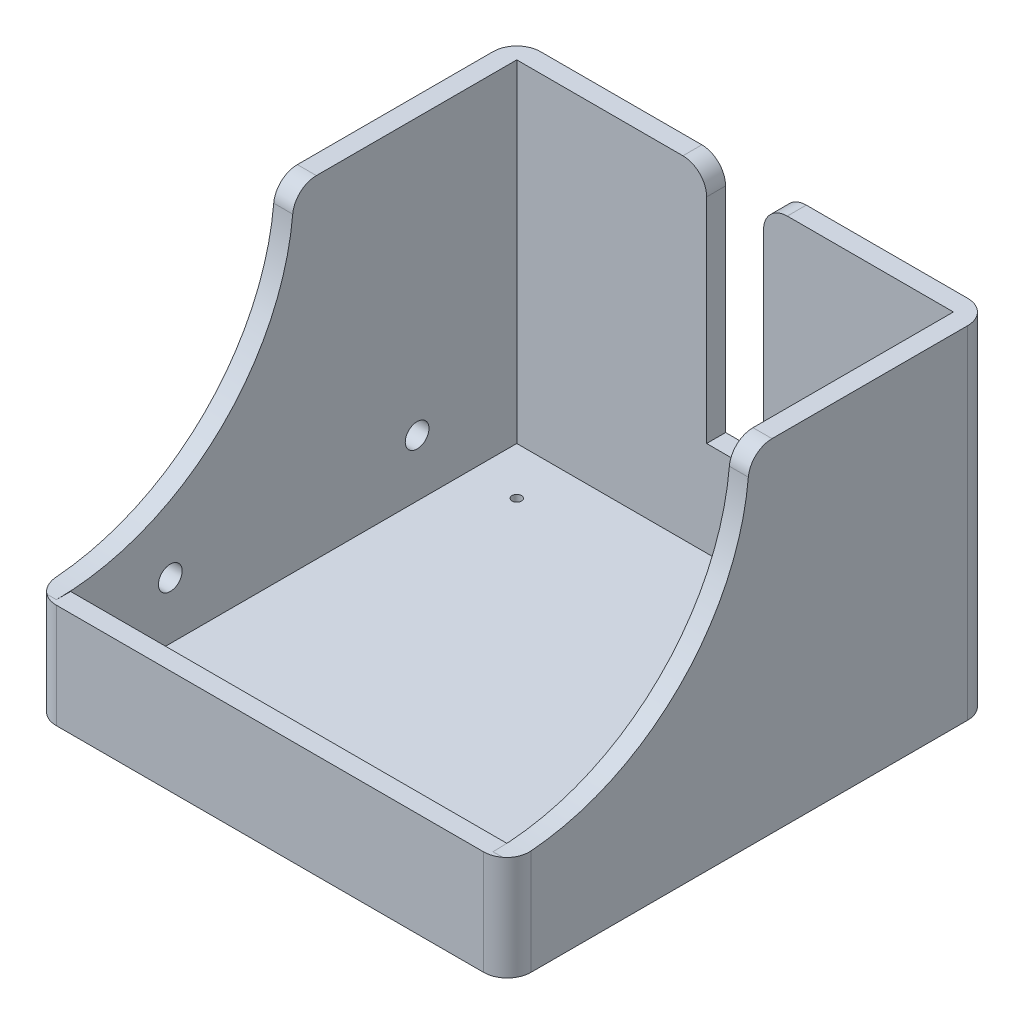
ISO-10303-21;
HEADER;
FILE_DESCRIPTION(('STEP AP214'),'2;1');
FILE_NAME('part.step','',(''),(''),'','','');
FILE_SCHEMA(('AUTOMOTIVE_DESIGN { 1 0 10303 214 1 1 1 1 }'));
ENDSEC;
DATA;
#1=APPLICATION_CONTEXT('core data for automotive mechanical design processes');
#2=APPLICATION_PROTOCOL_DEFINITION('international standard','automotive_design',2000,#1);
#3=PRODUCT_CONTEXT('',#1,'mechanical');
#4=PRODUCT('Part','Part','',(#3));
#5=PRODUCT_RELATED_PRODUCT_CATEGORY('part','',(#4));
#6=PRODUCT_DEFINITION_FORMATION('','',#4);
#7=PRODUCT_DEFINITION_CONTEXT('part definition',#1,'design');
#8=PRODUCT_DEFINITION('design','',#6,#7);
#9=PRODUCT_DEFINITION_SHAPE('','',#8);
#10=(LENGTH_UNIT() NAMED_UNIT(*) SI_UNIT(.MILLI.,.METRE.));
#11=(NAMED_UNIT(*) PLANE_ANGLE_UNIT() SI_UNIT($,.RADIAN.));
#12=(NAMED_UNIT(*) SI_UNIT($,.STERADIAN.) SOLID_ANGLE_UNIT());
#13=UNCERTAINTY_MEASURE_WITH_UNIT(LENGTH_MEASURE(1.E-05),#10,'distance_accuracy_value','');
#14=(GEOMETRIC_REPRESENTATION_CONTEXT(3) GLOBAL_UNCERTAINTY_ASSIGNED_CONTEXT((#13)) GLOBAL_UNIT_ASSIGNED_CONTEXT((#10,
#11,#12)) REPRESENTATION_CONTEXT('',''));
#15=CARTESIAN_POINT('',(0.,0.,0.));
#16=DIRECTION('',(0.,0.,1.));
#17=DIRECTION('',(1.,0.,0.));
#18=AXIS2_PLACEMENT_3D('',#15,#16,#17);
#19=CARTESIAN_POINT('',(-50.,65.,-4.77225575051662));
#20=DIRECTION('',(1.,0.,0.));
#21=DIRECTION('',(0.,0.,-1.));
#22=AXIS2_PLACEMENT_3D('',#19,#20,#21);
#23=CYLINDRICAL_SURFACE('',#22,5.);
#24=DIRECTION('',(1.,0.,0.));
#25=VECTOR('',#24,1.);
#26=CARTESIAN_POINT('',(-50.,65.4545454545455,0.207040226803075));
#27=LINE('',#26,#25);
#28=CARTESIAN_POINT('',(-46.,65.4545454545454,0.207040226803075));
#29=VERTEX_POINT('',#28);
#30=CARTESIAN_POINT('',(-50.,65.4545454545455,0.207040226803075));
#31=VERTEX_POINT('',#30);
#32=EDGE_CURVE('E516',#29,#31,#27,.F.);
#33=ORIENTED_EDGE('',*,*,#32,.F.);
#34=CARTESIAN_POINT('',(-46.,65.,-4.77225575051662));
#35=DIRECTION('',(1.,0.,0.));
#36=DIRECTION('',(0.,0.,-1.));
#37=AXIS2_PLACEMENT_3D('',#34,#35,#36);
#38=CIRCLE('',#37,5.);
#39=CARTESIAN_POINT('',(-46.,70.,-4.77225575051662));
#40=VERTEX_POINT('',#39);
#41=EDGE_CURVE('E46',#40,#29,#38,.T.);
#42=ORIENTED_EDGE('',*,*,#41,.F.);
#43=DIRECTION('',(1.,0.,0.));
#44=VECTOR('',#43,1.);
#45=CARTESIAN_POINT('',(-45.,70.,-4.77225575051662));
#46=LINE('',#45,#44);
#47=CARTESIAN_POINT('',(-50.,70.,-4.77225575051662));
#48=VERTEX_POINT('',#47);
#49=EDGE_CURVE('E518',#48,#40,#46,.T.);
#50=ORIENTED_EDGE('',*,*,#49,.F.);
#51=CARTESIAN_POINT('',(-50.,65.,-4.77225575051662));
#52=DIRECTION('',(1.,0.,0.));
#53=DIRECTION('',(0.,0.,-1.));
#54=AXIS2_PLACEMENT_3D('',#51,#52,#53);
#55=CIRCLE('',#54,5.);
#56=EDGE_CURVE('E11',#31,#48,#55,.F.);
#57=ORIENTED_EDGE('',*,*,#56,.F.);
#58=EDGE_LOOP('',(#33,#42,#50,#57));
#59=FACE_BOUND('',#58,.T.);
#60=ADVANCED_FACE('F39',(#59),#23,.T.);
#61=CARTESIAN_POINT('',(46.,65.,-4.77225575051662));
#62=DIRECTION('',(1.,0.,0.));
#63=DIRECTION('',(0.,0.,-1.));
#64=AXIS2_PLACEMENT_3D('',#61,#62,#63);
#65=CYLINDRICAL_SURFACE('',#64,5.);
#66=DIRECTION('',(1.,0.,0.));
#67=VECTOR('',#66,1.);
#68=CARTESIAN_POINT('',(46.,65.4545454545455,0.207040226803075));
#69=LINE('',#68,#67);
#70=CARTESIAN_POINT('',(50.,65.4545454545454,0.207040226803075));
#71=VERTEX_POINT('',#70);
#72=CARTESIAN_POINT('',(46.,65.4545454545454,0.207040226803075));
#73=VERTEX_POINT('',#72);
#74=EDGE_CURVE('E335',#71,#73,#69,.F.);
#75=ORIENTED_EDGE('',*,*,#74,.F.);
#76=CARTESIAN_POINT('',(50.,65.,-4.77225575051662));
#77=DIRECTION('',(-1.,0.,0.));
#78=DIRECTION('',(0.,0.,1.));
#79=AXIS2_PLACEMENT_3D('',#76,#77,#78);
#80=CIRCLE('',#79,5.);
#81=CARTESIAN_POINT('',(50.,70.,-4.77225575051632));
#82=VERTEX_POINT('',#81);
#83=EDGE_CURVE('E338',#82,#71,#80,.F.);
#84=ORIENTED_EDGE('',*,*,#83,.F.);
#85=DIRECTION('',(1.,0.,0.));
#86=VECTOR('',#85,1.);
#87=CARTESIAN_POINT('',(45.,70.,-4.77225575051662));
#88=LINE('',#87,#86);
#89=CARTESIAN_POINT('',(46.,70.,-4.77225575051662));
#90=VERTEX_POINT('',#89);
#91=EDGE_CURVE('E343',#90,#82,#88,.T.);
#92=ORIENTED_EDGE('',*,*,#91,.F.);
#93=CARTESIAN_POINT('',(46.,65.,-4.77225575051662));
#94=DIRECTION('',(-1.,0.,0.));
#95=DIRECTION('',(0.,0.,1.));
#96=AXIS2_PLACEMENT_3D('',#93,#94,#95);
#97=CIRCLE('',#96,5.);
#98=EDGE_CURVE('E340',#73,#90,#97,.T.);
#99=ORIENTED_EDGE('',*,*,#98,.F.);
#100=EDGE_LOOP('',(#75,#84,#92,#99));
#101=FACE_BOUND('',#100,.T.);
#102=ADVANCED_FACE('F324',(#101),#65,.T.);
#103=CARTESIAN_POINT('',(11.,65.,-51.));
#104=DIRECTION('',(0.,0.,-1.));
#105=DIRECTION('',(-1.,0.,0.));
#106=AXIS2_PLACEMENT_3D('',#103,#104,#105);
#107=CYLINDRICAL_SURFACE('',#106,5.);
#108=DIRECTION('',(0.,0.,-1.));
#109=VECTOR('',#108,1.);
#110=CARTESIAN_POINT('',(5.99999999999999,65.,-51.));
#111=LINE('',#110,#109);
#112=CARTESIAN_POINT('',(5.99999999999999,65.,-47.));
#113=VERTEX_POINT('',#112);
#114=CARTESIAN_POINT('',(5.99999999999999,65.,-51.));
#115=VERTEX_POINT('',#114);
#116=EDGE_CURVE('E205',#113,#115,#111,.T.);
#117=ORIENTED_EDGE('',*,*,#116,.F.);
#118=CARTESIAN_POINT('',(11.,65.,-47.));
#119=DIRECTION('',(0.,0.,1.));
#120=DIRECTION('',(1.,0.,0.));
#121=AXIS2_PLACEMENT_3D('',#118,#119,#120);
#122=CIRCLE('',#121,5.);
#123=CARTESIAN_POINT('',(11.,70.,-47.));
#124=VERTEX_POINT('',#123);
#125=EDGE_CURVE('E510',#124,#113,#122,.T.);
#126=ORIENTED_EDGE('',*,*,#125,.F.);
#127=DIRECTION('',(0.,0.,-1.));
#128=VECTOR('',#127,1.);
#129=CARTESIAN_POINT('',(11.,70.,-46.));
#130=LINE('',#129,#128);
#131=CARTESIAN_POINT('',(11.,70.,-51.));
#132=VERTEX_POINT('',#131);
#133=EDGE_CURVE('E507',#132,#124,#130,.F.);
#134=ORIENTED_EDGE('',*,*,#133,.F.);
#135=CARTESIAN_POINT('',(11.,65.,-51.));
#136=DIRECTION('',(0.,0.,1.));
#137=DIRECTION('',(1.,0.,0.));
#138=AXIS2_PLACEMENT_3D('',#135,#136,#137);
#139=CIRCLE('',#138,5.);
#140=EDGE_CURVE('E344',#115,#132,#139,.F.);
#141=ORIENTED_EDGE('',*,*,#140,.F.);
#142=EDGE_LOOP('',(#117,#126,#134,#141));
#143=FACE_BOUND('',#142,.T.);
#144=ADVANCED_FACE('F321',(#143),#107,.T.);
#145=CARTESIAN_POINT('',(-11.,65.,-51.));
#146=DIRECTION('',(0.,0.,1.));
#147=DIRECTION('',(1.,0.,0.));
#148=AXIS2_PLACEMENT_3D('',#145,#146,#147);
#149=CYLINDRICAL_SURFACE('',#148,5.);
#150=DIRECTION('',(0.,0.,1.));
#151=VECTOR('',#150,1.);
#152=CARTESIAN_POINT('',(-6.00000000000001,65.,-51.));
#153=LINE('',#152,#151);
#154=CARTESIAN_POINT('',(-6.00000000000001,65.,-51.));
#155=VERTEX_POINT('',#154);
#156=CARTESIAN_POINT('',(-6.00000000000001,65.,-47.));
#157=VERTEX_POINT('',#156);
#158=EDGE_CURVE('E494',#155,#157,#153,.T.);
#159=ORIENTED_EDGE('',*,*,#158,.F.);
#160=CARTESIAN_POINT('',(-11.,65.,-51.));
#161=DIRECTION('',(0.,0.,1.));
#162=DIRECTION('',(1.,0.,0.));
#163=AXIS2_PLACEMENT_3D('',#160,#161,#162);
#164=CIRCLE('',#163,5.);
#165=CARTESIAN_POINT('',(-11.,70.,-51.));
#166=VERTEX_POINT('',#165);
#167=EDGE_CURVE('E502',#166,#155,#164,.F.);
#168=ORIENTED_EDGE('',*,*,#167,.F.);
#169=DIRECTION('',(0.,0.,1.));
#170=VECTOR('',#169,1.);
#171=CARTESIAN_POINT('',(-11.,70.,-46.));
#172=LINE('',#171,#170);
#173=CARTESIAN_POINT('',(-11.,70.,-47.));
#174=VERTEX_POINT('',#173);
#175=EDGE_CURVE('E497',#174,#166,#172,.F.);
#176=ORIENTED_EDGE('',*,*,#175,.F.);
#177=CARTESIAN_POINT('',(-11.,65.,-47.));
#178=DIRECTION('',(0.,0.,1.));
#179=DIRECTION('',(1.,0.,0.));
#180=AXIS2_PLACEMENT_3D('',#177,#178,#179);
#181=CIRCLE('',#180,5.);
#182=EDGE_CURVE('E504',#157,#174,#181,.T.);
#183=ORIENTED_EDGE('',*,*,#182,.F.);
#184=EDGE_LOOP('',(#159,#168,#176,#183));
#185=FACE_BOUND('',#184,.T.);
#186=ADVANCED_FACE('F317',(#185),#149,.T.);
#187=CARTESIAN_POINT('',(-50.,70.,50.));
#188=DIRECTION('',(1.,0.,0.));
#189=DIRECTION('',(0.,0.,-1.));
#190=AXIS2_PLACEMENT_3D('',#187,#188,#189);
#191=CYLINDRICAL_SURFACE('',#190,50.);
#192=CARTESIAN_POINT('',(-46.,70.,50.));
#193=DIRECTION('',(1.,0.,0.));
#194=DIRECTION('',(0.,0.,-1.));
#195=AXIS2_PLACEMENT_3D('',#192,#193,#194);
#196=CIRCLE('',#195,50.);
#197=CARTESIAN_POINT('',(-46.,20.,50.));
#198=VERTEX_POINT('',#197);
#199=EDGE_CURVE('E492',#198,#29,#196,.T.);
#200=ORIENTED_EDGE('',*,*,#199,.T.);
#201=ORIENTED_EDGE('',*,*,#32,.T.);
#202=CARTESIAN_POINT('',(-50.,70.,50.));
#203=DIRECTION('',(1.,0.,0.));
#204=DIRECTION('',(0.,0.,-1.));
#205=AXIS2_PLACEMENT_3D('',#202,#203,#204);
#206=CIRCLE('',#205,50.);
#207=CARTESIAN_POINT('',(-50.0000000000023,20.1602568224914,45.9999999999997));
#208=VERTEX_POINT('',#207);
#209=EDGE_CURVE('E309',#31,#208,#206,.F.);
#210=ORIENTED_EDGE('',*,*,#209,.T.);
#211=CARTESIAN_POINT('',(-48.,20.,50.));
#212=CARTESIAN_POINT('',(-48.1123123251652,19.9999999621787,49.9157829697156));
#213=CARTESIAN_POINT('',(-48.2210566808221,20.0002127225069,49.8268176929407));
#214=CARTESIAN_POINT('',(-48.4306803005446,20.001208337083,49.6400688826818));
#215=CARTESIAN_POINT('',(-48.5315598434387,20.0019911711101,49.5422856620826));
#216=CARTESIAN_POINT('',(-48.7245798726093,20.004269605554,49.3387343544107));
#217=CARTESIAN_POINT('',(-48.8167339388138,20.0057640758023,49.2329791512277));
#218=CARTESIAN_POINT('',(-48.9918131893981,20.0095999288473,49.0141475279462));
#219=CARTESIAN_POINT('',(-49.0747385435184,20.0119412960639,48.9010712425622));
#220=CARTESIAN_POINT('',(-49.3088947249991,20.0204355089331,48.5518369135647));
#221=CARTESIAN_POINT('',(-49.4455059994393,20.0280584687343,48.3056730505683));
#222=CARTESIAN_POINT('',(-49.6754605481454,20.0480301377561,47.7940792880293));
#223=CARTESIAN_POINT('',(-49.7688035733922,20.0603788741739,47.5286492776157));
#224=CARTESIAN_POINT('',(-49.8744143952217,20.0826911412991,47.1223622843285));
#225=CARTESIAN_POINT('',(-49.9038763737808,20.0907538811201,46.9856641127528));
#226=CARTESIAN_POINT('',(-49.9512556598506,20.1081468129322,46.7103230919928));
#227=CARTESIAN_POINT('',(-49.96917270827,20.1174770333624,46.5716801992363));
#228=CARTESIAN_POINT('',(-49.9933506695898,20.1373928848912,46.2932637303609));
#229=CARTESIAN_POINT('',(-49.9995935320742,20.1479804332144,46.1534887383452));
#230=CARTESIAN_POINT('',(-50.0003686929585,20.1703310475078,45.8739976084017));
#231=CARTESIAN_POINT('',(-49.9949007713998,20.1820941355537,45.7342814716287));
#232=CARTESIAN_POINT('',(-49.9835775076746,20.1944106150313,45.5950861511387));
#233=B_SPLINE_CURVE_WITH_KNOTS('',3,(#211,#212,#213,#214,#215,#216,#217,#218,#219,#220,#221,
#222,#223,#224,#225,#226,#227,#228,#229,#230,#231,#232),.UNSPECIFIED.,.F.,.F.,(4,2,2,2,2,2,2,2,
2,2,4),(0.,0.421005170012259,0.841995407476477,1.26231927768689,1.68263541575301,
2.52326627872219,3.36390197966348,3.78369631925029,4.20350007953188,4.62395239784628,
5.04441261340953),.UNSPECIFIED.);
#234=CARTESIAN_POINT('',(-48.,20.,50.));
#235=VERTEX_POINT('',#234);
#236=EDGE_CURVE('E301',#235,#208,#233,.T.);
#237=ORIENTED_EDGE('',*,*,#236,.F.);
#238=DIRECTION('',(1.,0.,0.));
#239=VECTOR('',#238,1.);
#240=CARTESIAN_POINT('',(45.,20.,50.));
#241=LINE('',#240,#239);
#242=EDGE_CURVE('E310',#198,#235,#241,.F.);
#243=ORIENTED_EDGE('',*,*,#242,.F.);
#244=EDGE_LOOP('',(#200,#201,#210,#237,#243));
#245=FACE_BOUND('',#244,.T.);
#246=ADVANCED_FACE('F313',(#245),#191,.F.);
#247=CARTESIAN_POINT('',(46.,70.,50.));
#248=DIRECTION('',(1.,0.,0.));
#249=DIRECTION('',(0.,0.,-1.));
#250=AXIS2_PLACEMENT_3D('',#247,#248,#249);
#251=CYLINDRICAL_SURFACE('',#250,50.);
#252=CARTESIAN_POINT('',(50.,70.,50.));
#253=DIRECTION('',(-1.,0.,0.));
#254=DIRECTION('',(0.,0.,1.));
#255=AXIS2_PLACEMENT_3D('',#252,#253,#254);
#256=CIRCLE('',#255,50.);
#257=CARTESIAN_POINT('',(50.0000000000023,20.1602568224914,45.9999999999997));
#258=VERTEX_POINT('',#257);
#259=EDGE_CURVE('E348',#258,#71,#256,.F.);
#260=ORIENTED_EDGE('',*,*,#259,.T.);
#261=ORIENTED_EDGE('',*,*,#74,.T.);
#262=CARTESIAN_POINT('',(46.,70.,50.));
#263=DIRECTION('',(-1.,0.,0.));
#264=DIRECTION('',(0.,0.,1.));
#265=AXIS2_PLACEMENT_3D('',#262,#263,#264);
#266=CIRCLE('',#265,50.);
#267=CARTESIAN_POINT('',(46.,20.,50.));
#268=VERTEX_POINT('',#267);
#269=EDGE_CURVE('E265',#73,#268,#266,.T.);
#270=ORIENTED_EDGE('',*,*,#269,.T.);
#271=DIRECTION('',(1.,0.,0.));
#272=VECTOR('',#271,1.);
#273=CARTESIAN_POINT('',(45.,20.,50.));
#274=LINE('',#273,#272);
#275=CARTESIAN_POINT('',(48.,20.,50.));
#276=VERTEX_POINT('',#275);
#277=EDGE_CURVE('E254',#276,#268,#274,.F.);
#278=ORIENTED_EDGE('',*,*,#277,.F.);
#279=CARTESIAN_POINT('',(47.9999999999994,20.,50.0000000000004));
#280=CARTESIAN_POINT('',(48.1123123251647,19.9999999621787,49.9157829697161));
#281=CARTESIAN_POINT('',(48.2210566808216,20.0002127225069,49.8268176929412));
#282=CARTESIAN_POINT('',(48.4306803005441,20.001208337083,49.6400688826822));
#283=CARTESIAN_POINT('',(48.5315598434382,20.0019911711101,49.5422856620831));
#284=CARTESIAN_POINT('',(48.7245798726089,20.0042696055539,49.3387343544113));
#285=CARTESIAN_POINT('',(48.8167339388133,20.0057640758023,49.2329791512283));
#286=CARTESIAN_POINT('',(48.9918131893977,20.0095999288473,49.0141475279467));
#287=CARTESIAN_POINT('',(49.074738543518,20.0119412960639,48.9010712425627));
#288=CARTESIAN_POINT('',(49.3088947249988,20.0204355089331,48.5518369135653));
#289=CARTESIAN_POINT('',(49.445505999439,20.0280584687343,48.3056730505689));
#290=CARTESIAN_POINT('',(49.6754605481452,20.048030137756,47.79407928803));
#291=CARTESIAN_POINT('',(49.7688035733919,20.0603788741739,47.5286492776163));
#292=CARTESIAN_POINT('',(49.8744143952216,20.0826911412991,47.1223622843292));
#293=CARTESIAN_POINT('',(49.9038763737807,20.09075388112,46.9856641127535));
#294=CARTESIAN_POINT('',(49.9512556598505,20.1081468129321,46.7103230919935));
#295=CARTESIAN_POINT('',(49.96917270827,20.1174770333624,46.571680199237));
#296=CARTESIAN_POINT('',(49.9933506695898,20.1373928848911,46.2932637303616));
#297=CARTESIAN_POINT('',(49.9995935320742,20.1479804332144,46.1534887383458));
#298=CARTESIAN_POINT('',(50.0003686929585,20.1703310475078,45.8739976084024));
#299=CARTESIAN_POINT('',(49.9949007713998,20.1820941355537,45.7342814716294));
#300=CARTESIAN_POINT('',(49.9835775076747,20.1944106150312,45.5950861511394));
#301=B_SPLINE_CURVE_WITH_KNOTS('',3,(#279,#280,#281,#282,#283,#284,#285,#286,#287,#288,#289,
#290,#291,#292,#293,#294,#295,#296,#297,#298,#299,#300),.UNSPECIFIED.,.F.,.F.,(4,2,2,2,2,2,2,2,
2,2,4),(0.,0.421005170012259,0.841995407476478,1.26231927768689,1.68263541575301,
2.5232662787222,3.36390197966349,3.7836963192503,4.20350007953189,4.6239523978463,
5.04441261340955),.UNSPECIFIED.);
#302=EDGE_CURVE('E257',#258,#276,#301,.F.);
#303=ORIENTED_EDGE('',*,*,#302,.F.);
#304=EDGE_LOOP('',(#260,#261,#270,#278,#303));
#305=FACE_BOUND('',#304,.T.);
#306=ADVANCED_FACE('F267',(#305),#251,.F.);
#307=CARTESIAN_POINT('',(45.,20.,46.));
#308=DIRECTION('',(0.,1.,0.));
#309=DIRECTION('',(0.,0.,1.));
#310=AXIS2_PLACEMENT_3D('',#307,#308,#309);
#311=PLANE('',#310);
#312=DIRECTION('',(0.,0.,1.));
#313=VECTOR('',#312,1.);
#314=CARTESIAN_POINT('',(-46.,20.,-47.));
#315=LINE('',#314,#313);
#316=CARTESIAN_POINT('',(-46.,20.,47.));
#317=VERTEX_POINT('',#316);
#318=EDGE_CURVE('E350',#317,#198,#315,.T.);
#319=ORIENTED_EDGE('',*,*,#318,.T.);
#320=ORIENTED_EDGE('',*,*,#242,.T.);
#321=CARTESIAN_POINT('',(-45.,20.,46.));
#322=DIRECTION('',(0.,1.,0.));
#323=DIRECTION('',(0.,0.,-1.));
#324=AXIS2_PLACEMENT_3D('',#321,#322,#323);
#325=CIRCLE('',#324,5.);
#326=CARTESIAN_POINT('',(-45.,20.,51.));
#327=VERTEX_POINT('',#326);
#328=EDGE_CURVE('E225',#235,#327,#325,.T.);
#329=ORIENTED_EDGE('',*,*,#328,.T.);
#330=DIRECTION('',(1.,0.,0.));
#331=VECTOR('',#330,1.);
#332=CARTESIAN_POINT('',(-45.,20.,51.));
#333=LINE('',#332,#331);
#334=CARTESIAN_POINT('',(45.,20.,51.));
#335=VERTEX_POINT('',#334);
#336=EDGE_CURVE('E228',#327,#335,#333,.T.);
#337=ORIENTED_EDGE('',*,*,#336,.T.);
#338=CARTESIAN_POINT('',(45.,20.,46.));
#339=DIRECTION('',(0.,1.,0.));
#340=DIRECTION('',(0.,0.,1.));
#341=AXIS2_PLACEMENT_3D('',#338,#339,#340);
#342=CIRCLE('',#341,5.);
#343=EDGE_CURVE('E226',#335,#276,#342,.T.);
#344=ORIENTED_EDGE('',*,*,#343,.T.);
#345=ORIENTED_EDGE('',*,*,#277,.T.);
#346=DIRECTION('',(0.,0.,-1.));
#347=VECTOR('',#346,1.);
#348=CARTESIAN_POINT('',(46.,20.,-47.));
#349=LINE('',#348,#347);
#350=CARTESIAN_POINT('',(46.,20.,47.));
#351=VERTEX_POINT('',#350);
#352=EDGE_CURVE('E252',#268,#351,#349,.T.);
#353=ORIENTED_EDGE('',*,*,#352,.T.);
#354=DIRECTION('',(1.,0.,0.));
#355=VECTOR('',#354,1.);
#356=CARTESIAN_POINT('',(-46.,20.,47.));
#357=LINE('',#356,#355);
#358=EDGE_CURVE('E370',#317,#351,#357,.T.);
#359=ORIENTED_EDGE('',*,*,#358,.F.);
#360=EDGE_LOOP('',(#319,#320,#329,#337,#344,#345,#353,#359));
#361=FACE_BOUND('',#360,.T.);
#362=ADVANCED_FACE('F355',(#361),#311,.T.);
#363=DIRECTION('',(-1.,0.,0.));
#364=VECTOR('',#363,1.);
#365=CARTESIAN_POINT('',(-46.,20.,-47.));
#366=LINE('',#365,#364);
#367=CARTESIAN_POINT('',(5.99999999999999,20.,-47.));
#368=VERTEX_POINT('',#367);
#369=CARTESIAN_POINT('',(-6.00000000000001,20.,-47.));
#370=VERTEX_POINT('',#369);
#371=EDGE_CURVE('E218',#368,#370,#366,.T.);
#372=ORIENTED_EDGE('',*,*,#371,.F.);
#373=DIRECTION('',(0.,0.,1.));
#374=VECTOR('',#373,1.);
#375=CARTESIAN_POINT('',(5.99999999999999,20.,-51.));
#376=LINE('',#375,#374);
#377=CARTESIAN_POINT('',(5.99999999999999,20.,-51.));
#378=VERTEX_POINT('',#377);
#379=EDGE_CURVE('E202',#378,#368,#376,.T.);
#380=ORIENTED_EDGE('',*,*,#379,.F.);
#381=DIRECTION('',(-1.,0.,0.));
#382=VECTOR('',#381,1.);
#383=CARTESIAN_POINT('',(-45.,20.,-51.));
#384=LINE('',#383,#382);
#385=CARTESIAN_POINT('',(-6.00000000000001,20.,-51.));
#386=VERTEX_POINT('',#385);
#387=EDGE_CURVE('E215',#378,#386,#384,.T.);
#388=ORIENTED_EDGE('',*,*,#387,.T.);
#389=DIRECTION('',(0.,0.,-1.));
#390=VECTOR('',#389,1.);
#391=CARTESIAN_POINT('',(-6.00000000000001,20.,-51.));
#392=LINE('',#391,#390);
#393=EDGE_CURVE('E219',#370,#386,#392,.T.);
#394=ORIENTED_EDGE('',*,*,#393,.F.);
#395=EDGE_LOOP('',(#372,#380,#388,#394));
#396=FACE_BOUND('',#395,.T.);
#397=ADVANCED_FACE('F213',(#396),#311,.T.);
#398=CARTESIAN_POINT('',(45.,20.,46.));
#399=DIRECTION('',(0.,-1.,0.));
#400=DIRECTION('',(0.,0.,-1.));
#401=AXIS2_PLACEMENT_3D('',#398,#399,#400);
#402=CYLINDRICAL_SURFACE('',#401,5.);
#403=DIRECTION('',(0.,-1.,0.));
#404=VECTOR('',#403,1.);
#405=CARTESIAN_POINT('',(45.,20.,51.));
#406=LINE('',#405,#404);
#407=CARTESIAN_POINT('',(45.,-2.,51.));
#408=VERTEX_POINT('',#407);
#409=EDGE_CURVE('E236',#335,#408,#406,.T.);
#410=ORIENTED_EDGE('',*,*,#409,.T.);
#411=CARTESIAN_POINT('',(45.,-2.,46.));
#412=DIRECTION('',(0.,-1.,0.));
#413=DIRECTION('',(0.,0.,-1.));
#414=AXIS2_PLACEMENT_3D('',#411,#412,#413);
#415=CIRCLE('',#414,5.);
#416=CARTESIAN_POINT('',(50.,-2.,46.));
#417=VERTEX_POINT('',#416);
#418=EDGE_CURVE('E406',#417,#408,#415,.T.);
#419=ORIENTED_EDGE('',*,*,#418,.F.);
#420=DIRECTION('',(0.,-1.,0.));
#421=VECTOR('',#420,1.);
#422=CARTESIAN_POINT('',(50.,20.,46.));
#423=LINE('',#422,#421);
#424=EDGE_CURVE('E250',#258,#417,#423,.T.);
#425=ORIENTED_EDGE('',*,*,#424,.F.);
#426=ORIENTED_EDGE('',*,*,#302,.T.);
#427=ORIENTED_EDGE('',*,*,#343,.F.);
#428=EDGE_LOOP('',(#410,#419,#425,#426,#427));
#429=FACE_BOUND('',#428,.T.);
#430=ADVANCED_FACE('F270',(#429),#402,.T.);
#431=CARTESIAN_POINT('',(50.,20.,-46.));
#432=DIRECTION('',(-1.,0.,0.));
#433=DIRECTION('',(0.,0.,1.));
#434=AXIS2_PLACEMENT_3D('',#431,#432,#433);
#435=PLANE('',#434);
#436=DIRECTION('',(0.,0.,-1.));
#437=VECTOR('',#436,1.);
#438=CARTESIAN_POINT('',(50.,70.,0.));
#439=LINE('',#438,#437);
#440=CARTESIAN_POINT('',(50.,70.,-46.));
#441=VERTEX_POINT('',#440);
#442=EDGE_CURVE('E464',#82,#441,#439,.T.);
#443=ORIENTED_EDGE('',*,*,#442,.F.);
#444=ORIENTED_EDGE('',*,*,#83,.T.);
#445=ORIENTED_EDGE('',*,*,#259,.F.);
#446=ORIENTED_EDGE('',*,*,#424,.T.);
#447=DIRECTION('',(0.,0.,1.));
#448=VECTOR('',#447,1.);
#449=CARTESIAN_POINT('',(50.,-2.,-46.));
#450=LINE('',#449,#448);
#451=CARTESIAN_POINT('',(50.,-2.,-46.));
#452=VERTEX_POINT('',#451);
#453=EDGE_CURVE('E409',#452,#417,#450,.T.);
#454=ORIENTED_EDGE('',*,*,#453,.F.);
#455=DIRECTION('',(0.,-1.,0.));
#456=VECTOR('',#455,1.);
#457=CARTESIAN_POINT('',(50.,20.,-46.));
#458=LINE('',#457,#456);
#459=EDGE_CURVE('E248',#441,#452,#458,.T.);
#460=ORIENTED_EDGE('',*,*,#459,.F.);
#461=EDGE_LOOP('',(#443,#444,#445,#446,#454,#460));
#462=FACE_BOUND('',#461,.T.);
#463=ADVANCED_FACE('F274',(#462),#435,.F.);
#464=CARTESIAN_POINT('',(45.,20.,-46.));
#465=DIRECTION('',(0.,-1.,0.));
#466=DIRECTION('',(0.,0.,-1.));
#467=AXIS2_PLACEMENT_3D('',#464,#465,#466);
#468=CYLINDRICAL_SURFACE('',#467,5.);
#469=ORIENTED_EDGE('',*,*,#459,.T.);
#470=CARTESIAN_POINT('',(45.,-2.,-46.));
#471=DIRECTION('',(0.,-1.,0.));
#472=DIRECTION('',(0.,0.,-1.));
#473=AXIS2_PLACEMENT_3D('',#470,#471,#472);
#474=CIRCLE('',#473,5.);
#475=CARTESIAN_POINT('',(45.,-2.,-51.));
#476=VERTEX_POINT('',#475);
#477=EDGE_CURVE('E412',#476,#452,#474,.T.);
#478=ORIENTED_EDGE('',*,*,#477,.F.);
#479=DIRECTION('',(0.,-1.,0.));
#480=VECTOR('',#479,1.);
#481=CARTESIAN_POINT('',(45.,20.,-51.));
#482=LINE('',#481,#480);
#483=CARTESIAN_POINT('',(45.,70.,-51.));
#484=VERTEX_POINT('',#483);
#485=EDGE_CURVE('E246',#484,#476,#482,.T.);
#486=ORIENTED_EDGE('',*,*,#485,.F.);
#487=CARTESIAN_POINT('',(45.,70.,-46.));
#488=DIRECTION('',(0.,1.,0.));
#489=DIRECTION('',(0.,0.,-1.));
#490=AXIS2_PLACEMENT_3D('',#487,#488,#489);
#491=CIRCLE('',#490,5.);
#492=EDGE_CURVE('E466',#441,#484,#491,.T.);
#493=ORIENTED_EDGE('',*,*,#492,.F.);
#494=EDGE_LOOP('',(#469,#478,#486,#493));
#495=FACE_BOUND('',#494,.T.);
#496=ADVANCED_FACE('F278',(#495),#468,.T.);
#497=CARTESIAN_POINT('',(-45.,20.,-51.));
#498=DIRECTION('',(0.,0.,1.));
#499=DIRECTION('',(1.,0.,0.));
#500=AXIS2_PLACEMENT_3D('',#497,#498,#499);
#501=PLANE('',#500);
#502=DIRECTION('',(0.,-1.,0.));
#503=VECTOR('',#502,1.);
#504=CARTESIAN_POINT('',(5.99999999999999,70.,-51.));
#505=LINE('',#504,#503);
#506=EDGE_CURVE('E198',#115,#378,#505,.T.);
#507=ORIENTED_EDGE('',*,*,#506,.F.);
#508=ORIENTED_EDGE('',*,*,#140,.T.);
#509=DIRECTION('',(-1.,0.,0.));
#510=VECTOR('',#509,1.);
#511=CARTESIAN_POINT('',(45.,70.,-51.));
#512=LINE('',#511,#510);
#513=EDGE_CURVE('E469',#484,#132,#512,.T.);
#514=ORIENTED_EDGE('',*,*,#513,.F.);
#515=ORIENTED_EDGE('',*,*,#485,.T.);
#516=DIRECTION('',(1.,0.,0.));
#517=VECTOR('',#516,1.);
#518=CARTESIAN_POINT('',(-45.,-2.,-51.));
#519=LINE('',#518,#517);
#520=CARTESIAN_POINT('',(-45.,-2.,-51.));
#521=VERTEX_POINT('',#520);
#522=EDGE_CURVE('E415',#521,#476,#519,.T.);
#523=ORIENTED_EDGE('',*,*,#522,.F.);
#524=DIRECTION('',(0.,-1.,0.));
#525=VECTOR('',#524,1.);
#526=CARTESIAN_POINT('',(-45.,20.,-51.));
#527=LINE('',#526,#525);
#528=CARTESIAN_POINT('',(-45.,70.,-51.));
#529=VERTEX_POINT('',#528);
#530=EDGE_CURVE('E244',#529,#521,#527,.T.);
#531=ORIENTED_EDGE('',*,*,#530,.F.);
#532=DIRECTION('',(-1.,0.,0.));
#533=VECTOR('',#532,1.);
#534=CARTESIAN_POINT('',(-6.00000000000001,70.,-51.));
#535=LINE('',#534,#533);
#536=EDGE_CURVE('E453',#166,#529,#535,.T.);
#537=ORIENTED_EDGE('',*,*,#536,.F.);
#538=ORIENTED_EDGE('',*,*,#167,.T.);
#539=DIRECTION('',(0.,-1.,0.));
#540=VECTOR('',#539,1.);
#541=CARTESIAN_POINT('',(-6.00000000000001,70.,-51.));
#542=LINE('',#541,#540);
#543=EDGE_CURVE('E224',#155,#386,#542,.T.);
#544=ORIENTED_EDGE('',*,*,#543,.T.);
#545=ORIENTED_EDGE('',*,*,#387,.F.);
#546=EDGE_LOOP('',(#507,#508,#514,#515,#523,#531,#537,#538,#544,#545));
#547=FACE_BOUND('',#546,.T.);
#548=ADVANCED_FACE('F222',(#547),#501,.F.);
#549=CARTESIAN_POINT('',(-45.,20.,-46.));
#550=DIRECTION('',(0.,-1.,0.));
#551=DIRECTION('',(0.,0.,-1.));
#552=AXIS2_PLACEMENT_3D('',#549,#550,#551);
#553=CYLINDRICAL_SURFACE('',#552,5.);
#554=ORIENTED_EDGE('',*,*,#530,.T.);
#555=CARTESIAN_POINT('',(-45.,-2.,-46.));
#556=DIRECTION('',(0.,-1.,0.));
#557=DIRECTION('',(0.,0.,-1.));
#558=AXIS2_PLACEMENT_3D('',#555,#556,#557);
#559=CIRCLE('',#558,5.);
#560=CARTESIAN_POINT('',(-50.,-2.,-46.));
#561=VERTEX_POINT('',#560);
#562=EDGE_CURVE('E418',#561,#521,#559,.T.);
#563=ORIENTED_EDGE('',*,*,#562,.F.);
#564=DIRECTION('',(0.,-1.,0.));
#565=VECTOR('',#564,1.);
#566=CARTESIAN_POINT('',(-50.,20.,-46.));
#567=LINE('',#566,#565);
#568=CARTESIAN_POINT('',(-50.,70.,-46.));
#569=VERTEX_POINT('',#568);
#570=EDGE_CURVE('E242',#569,#561,#567,.T.);
#571=ORIENTED_EDGE('',*,*,#570,.F.);
#572=CARTESIAN_POINT('',(-45.,70.,-46.));
#573=DIRECTION('',(0.,1.,0.));
#574=DIRECTION('',(0.,0.,-1.));
#575=AXIS2_PLACEMENT_3D('',#572,#573,#574);
#576=CIRCLE('',#575,5.);
#577=EDGE_CURVE('E448',#529,#569,#576,.T.);
#578=ORIENTED_EDGE('',*,*,#577,.F.);
#579=EDGE_LOOP('',(#554,#563,#571,#578));
#580=FACE_BOUND('',#579,.T.);
#581=ADVANCED_FACE('F285',(#580),#553,.T.);
#582=CARTESIAN_POINT('',(-50.,20.,-46.));
#583=DIRECTION('',(1.,0.,0.));
#584=DIRECTION('',(0.,0.,-1.));
#585=AXIS2_PLACEMENT_3D('',#582,#583,#584);
#586=PLANE('',#585);
#587=CARTESIAN_POINT('',(-50.,12.,-26.));
#588=DIRECTION('',(-1.,0.,0.));
#589=DIRECTION('',(0.,0.,1.));
#590=AXIS2_PLACEMENT_3D('',#587,#588,#589);
#591=CIRCLE('',#590,2.5);
#592=CARTESIAN_POINT('',(-50.,12.,-23.5));
#593=VERTEX_POINT('',#592);
#594=EDGE_CURVE('E476',#593,#593,#591,.T.);
#595=ORIENTED_EDGE('',*,*,#594,.F.);
#596=EDGE_LOOP('',(#595));
#597=FACE_BOUND('',#596,.T.);
#598=CARTESIAN_POINT('',(-50.,12.,25.9999999999997));
#599=DIRECTION('',(-1.,0.,0.));
#600=DIRECTION('',(0.,0.,1.));
#601=AXIS2_PLACEMENT_3D('',#598,#599,#600);
#602=CIRCLE('',#601,2.5);
#603=CARTESIAN_POINT('',(-50.,12.,28.4999999999997));
#604=VERTEX_POINT('',#603);
#605=EDGE_CURVE('E473',#604,#604,#602,.T.);
#606=ORIENTED_EDGE('',*,*,#605,.F.);
#607=EDGE_LOOP('',(#606));
#608=FACE_BOUND('',#607,.T.);
#609=ORIENTED_EDGE('',*,*,#209,.F.);
#610=ORIENTED_EDGE('',*,*,#56,.T.);
#611=DIRECTION('',(0.,0.,1.));
#612=VECTOR('',#611,1.);
#613=CARTESIAN_POINT('',(-50.,70.,-46.));
#614=LINE('',#613,#612);
#615=EDGE_CURVE('E450',#569,#48,#614,.T.);
#616=ORIENTED_EDGE('',*,*,#615,.F.);
#617=ORIENTED_EDGE('',*,*,#570,.T.);
#618=DIRECTION('',(0.,0.,-1.));
#619=VECTOR('',#618,1.);
#620=CARTESIAN_POINT('',(-50.,-2.,-46.));
#621=LINE('',#620,#619);
#622=CARTESIAN_POINT('',(-50.,-2.,46.));
#623=VERTEX_POINT('',#622);
#624=EDGE_CURVE('E390',#623,#561,#621,.T.);
#625=ORIENTED_EDGE('',*,*,#624,.F.);
#626=DIRECTION('',(0.,-1.,0.));
#627=VECTOR('',#626,1.);
#628=CARTESIAN_POINT('',(-50.,20.,46.));
#629=LINE('',#628,#627);
#630=EDGE_CURVE('E240',#208,#623,#629,.T.);
#631=ORIENTED_EDGE('',*,*,#630,.F.);
#632=EDGE_LOOP('',(#609,#610,#616,#617,#625,#631));
#633=FACE_BOUND('',#632,.T.);
#634=ADVANCED_FACE('F288',(#597,#608,#633),#586,.F.);
#635=CARTESIAN_POINT('',(-45.,20.,46.));
#636=DIRECTION('',(0.,-1.,0.));
#637=DIRECTION('',(0.,0.,-1.));
#638=AXIS2_PLACEMENT_3D('',#635,#636,#637);
#639=CYLINDRICAL_SURFACE('',#638,5.);
#640=ORIENTED_EDGE('',*,*,#630,.T.);
#641=CARTESIAN_POINT('',(-45.,-2.,46.));
#642=DIRECTION('',(0.,-1.,0.));
#643=DIRECTION('',(0.,0.,-1.));
#644=AXIS2_PLACEMENT_3D('',#641,#642,#643);
#645=CIRCLE('',#644,5.);
#646=CARTESIAN_POINT('',(-45.,-2.,51.));
#647=VERTEX_POINT('',#646);
#648=EDGE_CURVE('E395',#647,#623,#645,.T.);
#649=ORIENTED_EDGE('',*,*,#648,.F.);
#650=DIRECTION('',(0.,-1.,0.));
#651=VECTOR('',#650,1.);
#652=CARTESIAN_POINT('',(-45.,20.,51.));
#653=LINE('',#652,#651);
#654=EDGE_CURVE('E238',#327,#647,#653,.T.);
#655=ORIENTED_EDGE('',*,*,#654,.F.);
#656=ORIENTED_EDGE('',*,*,#328,.F.);
#657=ORIENTED_EDGE('',*,*,#236,.T.);
#658=EDGE_LOOP('',(#640,#649,#655,#656,#657));
#659=FACE_BOUND('',#658,.T.);
#660=ADVANCED_FACE('F292',(#659),#639,.T.);
#661=CARTESIAN_POINT('',(-45.,20.,51.));
#662=DIRECTION('',(0.,0.,-1.));
#663=DIRECTION('',(-1.,0.,0.));
#664=AXIS2_PLACEMENT_3D('',#661,#662,#663);
#665=PLANE('',#664);
#666=ORIENTED_EDGE('',*,*,#654,.T.);
#667=DIRECTION('',(-1.,0.,0.));
#668=VECTOR('',#667,1.);
#669=CARTESIAN_POINT('',(-45.,-2.,51.));
#670=LINE('',#669,#668);
#671=EDGE_CURVE('E403',#408,#647,#670,.T.);
#672=ORIENTED_EDGE('',*,*,#671,.F.);
#673=ORIENTED_EDGE('',*,*,#409,.F.);
#674=ORIENTED_EDGE('',*,*,#336,.F.);
#675=EDGE_LOOP('',(#666,#672,#673,#674));
#676=FACE_BOUND('',#675,.T.);
#677=ADVANCED_FACE('F297',(#676),#665,.F.);
#678=CARTESIAN_POINT('',(46.,20.,-47.));
#679=DIRECTION('',(-1.,0.,0.));
#680=DIRECTION('',(0.,0.,1.));
#681=AXIS2_PLACEMENT_3D('',#678,#679,#680);
#682=PLANE('',#681);
#683=ORIENTED_EDGE('',*,*,#269,.F.);
#684=ORIENTED_EDGE('',*,*,#98,.T.);
#685=DIRECTION('',(0.,0.,1.));
#686=VECTOR('',#685,1.);
#687=CARTESIAN_POINT('',(46.,70.,-47.));
#688=LINE('',#687,#686);
#689=CARTESIAN_POINT('',(46.,70.,-47.));
#690=VERTEX_POINT('',#689);
#691=EDGE_CURVE('E382',#690,#90,#688,.T.);
#692=ORIENTED_EDGE('',*,*,#691,.F.);
#693=DIRECTION('',(0.,-1.,0.));
#694=VECTOR('',#693,1.);
#695=CARTESIAN_POINT('',(46.,20.,-47.));
#696=LINE('',#695,#694);
#697=CARTESIAN_POINT('',(46.,0.,-47.));
#698=VERTEX_POINT('',#697);
#699=EDGE_CURVE('E231',#690,#698,#696,.T.);
#700=ORIENTED_EDGE('',*,*,#699,.T.);
#701=DIRECTION('',(0.,0.,-1.));
#702=VECTOR('',#701,1.);
#703=CARTESIAN_POINT('',(46.,0.,-47.));
#704=LINE('',#703,#702);
#705=CARTESIAN_POINT('',(46.,0.,47.));
#706=VERTEX_POINT('',#705);
#707=EDGE_CURVE('E365',#706,#698,#704,.T.);
#708=ORIENTED_EDGE('',*,*,#707,.F.);
#709=DIRECTION('',(0.,-1.,0.));
#710=VECTOR('',#709,1.);
#711=CARTESIAN_POINT('',(46.,20.,47.));
#712=LINE('',#711,#710);
#713=EDGE_CURVE('E362',#351,#706,#712,.T.);
#714=ORIENTED_EDGE('',*,*,#713,.F.);
#715=ORIENTED_EDGE('',*,*,#352,.F.);
#716=EDGE_LOOP('',(#683,#684,#692,#700,#708,#714,#715));
#717=FACE_BOUND('',#716,.T.);
#718=ADVANCED_FACE('F360',(#717),#682,.T.);
#719=CARTESIAN_POINT('',(-46.,20.,-47.));
#720=DIRECTION('',(0.,0.,1.));
#721=DIRECTION('',(1.,0.,0.));
#722=AXIS2_PLACEMENT_3D('',#719,#720,#721);
#723=PLANE('',#722);
#724=DIRECTION('',(1.,0.,0.));
#725=VECTOR('',#724,1.);
#726=CARTESIAN_POINT('',(5.99999999999999,70.,-47.));
#727=LINE('',#726,#725);
#728=EDGE_CURVE('E220',#124,#690,#727,.T.);
#729=ORIENTED_EDGE('',*,*,#728,.F.);
#730=ORIENTED_EDGE('',*,*,#125,.T.);
#731=DIRECTION('',(0.,-1.,0.));
#732=VECTOR('',#731,1.);
#733=CARTESIAN_POINT('',(5.99999999999999,70.,-47.));
#734=LINE('',#733,#732);
#735=EDGE_CURVE('E208',#113,#368,#734,.T.);
#736=ORIENTED_EDGE('',*,*,#735,.T.);
#737=ORIENTED_EDGE('',*,*,#371,.T.);
#738=DIRECTION('',(0.,-1.,0.));
#739=VECTOR('',#738,1.);
#740=CARTESIAN_POINT('',(-6.00000000000001,70.,-47.));
#741=LINE('',#740,#739);
#742=EDGE_CURVE('E443',#157,#370,#741,.T.);
#743=ORIENTED_EDGE('',*,*,#742,.F.);
#744=ORIENTED_EDGE('',*,*,#182,.T.);
#745=DIRECTION('',(1.,0.,0.));
#746=VECTOR('',#745,1.);
#747=CARTESIAN_POINT('',(-46.,70.,-47.));
#748=LINE('',#747,#746);
#749=CARTESIAN_POINT('',(-46.,70.,-47.));
#750=VERTEX_POINT('',#749);
#751=EDGE_CURVE('E455',#750,#174,#748,.T.);
#752=ORIENTED_EDGE('',*,*,#751,.F.);
#753=DIRECTION('',(0.,-1.,0.));
#754=VECTOR('',#753,1.);
#755=CARTESIAN_POINT('',(-46.,20.,-47.));
#756=LINE('',#755,#754);
#757=CARTESIAN_POINT('',(-46.,0.,-47.));
#758=VERTEX_POINT('',#757);
#759=EDGE_CURVE('E372',#750,#758,#756,.T.);
#760=ORIENTED_EDGE('',*,*,#759,.T.);
#761=DIRECTION('',(-1.,0.,0.));
#762=VECTOR('',#761,1.);
#763=CARTESIAN_POINT('',(-46.,0.,-47.));
#764=LINE('',#763,#762);
#765=EDGE_CURVE('E389',#698,#758,#764,.T.);
#766=ORIENTED_EDGE('',*,*,#765,.F.);
#767=ORIENTED_EDGE('',*,*,#699,.F.);
#768=EDGE_LOOP('',(#729,#730,#736,#737,#743,#744,#752,#760,#766,#767));
#769=FACE_BOUND('',#768,.T.);
#770=ADVANCED_FACE('F559',(#769),#723,.T.);
#771=CARTESIAN_POINT('',(-46.,20.,-47.));
#772=DIRECTION('',(1.,0.,0.));
#773=DIRECTION('',(0.,0.,-1.));
#774=AXIS2_PLACEMENT_3D('',#771,#772,#773);
#775=PLANE('',#774);
#776=CARTESIAN_POINT('',(-46.,12.,-26.));
#777=DIRECTION('',(1.,0.,0.));
#778=DIRECTION('',(0.,0.,-1.));
#779=AXIS2_PLACEMENT_3D('',#776,#777,#778);
#780=CIRCLE('',#779,2.5);
#781=CARTESIAN_POINT('',(-46.,12.,-28.5));
#782=VERTEX_POINT('',#781);
#783=EDGE_CURVE('E209',#782,#782,#780,.F.);
#784=ORIENTED_EDGE('',*,*,#783,.T.);
#785=EDGE_LOOP('',(#784));
#786=FACE_BOUND('',#785,.T.);
#787=CARTESIAN_POINT('',(-46.,12.,25.9999999999997));
#788=DIRECTION('',(1.,0.,0.));
#789=DIRECTION('',(0.,0.,-1.));
#790=AXIS2_PLACEMENT_3D('',#787,#788,#789);
#791=CIRCLE('',#790,2.5);
#792=CARTESIAN_POINT('',(-46.,12.,23.4999999999997));
#793=VERTEX_POINT('',#792);
#794=EDGE_CURVE('E477',#793,#793,#791,.F.);
#795=ORIENTED_EDGE('',*,*,#794,.T.);
#796=EDGE_LOOP('',(#795));
#797=FACE_BOUND('',#796,.T.);
#798=DIRECTION('',(0.,0.,-1.));
#799=VECTOR('',#798,1.);
#800=CARTESIAN_POINT('',(-46.,70.,0.));
#801=LINE('',#800,#799);
#802=EDGE_CURVE('E458',#40,#750,#801,.T.);
#803=ORIENTED_EDGE('',*,*,#802,.F.);
#804=ORIENTED_EDGE('',*,*,#41,.T.);
#805=ORIENTED_EDGE('',*,*,#199,.F.);
#806=ORIENTED_EDGE('',*,*,#318,.F.);
#807=DIRECTION('',(0.,-1.,0.));
#808=VECTOR('',#807,1.);
#809=CARTESIAN_POINT('',(-46.,20.,47.));
#810=LINE('',#809,#808);
#811=CARTESIAN_POINT('',(-46.,0.,47.));
#812=VERTEX_POINT('',#811);
#813=EDGE_CURVE('E369',#317,#812,#810,.T.);
#814=ORIENTED_EDGE('',*,*,#813,.T.);
#815=DIRECTION('',(0.,0.,1.));
#816=VECTOR('',#815,1.);
#817=CARTESIAN_POINT('',(-46.,0.,-47.));
#818=LINE('',#817,#816);
#819=EDGE_CURVE('E392',#758,#812,#818,.T.);
#820=ORIENTED_EDGE('',*,*,#819,.F.);
#821=ORIENTED_EDGE('',*,*,#759,.F.);
#822=EDGE_LOOP('',(#803,#804,#805,#806,#814,#820,#821));
#823=FACE_BOUND('',#822,.T.);
#824=ADVANCED_FACE('F521',(#786,#797,#823),#775,.T.);
#825=CARTESIAN_POINT('',(-46.,20.,47.));
#826=DIRECTION('',(0.,0.,-1.));
#827=DIRECTION('',(-1.,0.,0.));
#828=AXIS2_PLACEMENT_3D('',#825,#826,#827);
#829=PLANE('',#828);
#830=DIRECTION('',(1.,0.,0.));
#831=VECTOR('',#830,1.);
#832=CARTESIAN_POINT('',(-46.,0.,47.));
#833=LINE('',#832,#831);
#834=EDGE_CURVE('E376',#812,#706,#833,.T.);
#835=ORIENTED_EDGE('',*,*,#834,.F.);
#836=ORIENTED_EDGE('',*,*,#813,.F.);
#837=ORIENTED_EDGE('',*,*,#358,.T.);
#838=ORIENTED_EDGE('',*,*,#713,.T.);
#839=EDGE_LOOP('',(#835,#836,#837,#838));
#840=FACE_BOUND('',#839,.T.);
#841=ADVANCED_FACE('F549',(#840),#829,.T.);
#842=CARTESIAN_POINT('',(-45.,0.,-46.));
#843=DIRECTION('',(0.,-1.,0.));
#844=DIRECTION('',(0.,0.,-1.));
#845=AXIS2_PLACEMENT_3D('',#842,#843,#844);
#846=PLANE('',#845);
#847=CARTESIAN_POINT('',(-36.,0.,-37.));
#848=DIRECTION('',(0.,-1.,0.));
#849=DIRECTION('',(0.,0.,-1.));
#850=AXIS2_PLACEMENT_3D('',#847,#848,#849);
#851=CIRCLE('',#850,0.999999999999998);
#852=CARTESIAN_POINT('',(-36.,0.,-38.));
#853=VERTEX_POINT('',#852);
#854=EDGE_CURVE('E440',#853,#853,#851,.T.);
#855=ORIENTED_EDGE('',*,*,#854,.T.);
#856=EDGE_LOOP('',(#855));
#857=FACE_BOUND('',#856,.T.);
#858=CARTESIAN_POINT('',(36.,0.,-37.));
#859=DIRECTION('',(0.,-1.,0.));
#860=DIRECTION('',(0.,0.,-1.));
#861=AXIS2_PLACEMENT_3D('',#858,#859,#860);
#862=CIRCLE('',#861,0.999999999999998);
#863=CARTESIAN_POINT('',(36.,0.,-38.));
#864=VERTEX_POINT('',#863);
#865=EDGE_CURVE('E434',#864,#864,#862,.T.);
#866=ORIENTED_EDGE('',*,*,#865,.T.);
#867=EDGE_LOOP('',(#866));
#868=FACE_BOUND('',#867,.T.);
#869=CARTESIAN_POINT('',(36.,0.,37.));
#870=DIRECTION('',(0.,-1.,0.));
#871=DIRECTION('',(0.,0.,-1.));
#872=AXIS2_PLACEMENT_3D('',#869,#870,#871);
#873=CIRCLE('',#872,1.00741352794652);
#874=CARTESIAN_POINT('',(36.,0.,35.9925864720535));
#875=VERTEX_POINT('',#874);
#876=EDGE_CURVE('E428',#875,#875,#873,.T.);
#877=ORIENTED_EDGE('',*,*,#876,.T.);
#878=EDGE_LOOP('',(#877));
#879=FACE_BOUND('',#878,.T.);
#880=CARTESIAN_POINT('',(-36.,0.,37.));
#881=DIRECTION('',(0.,-1.,0.));
#882=DIRECTION('',(0.,0.,-1.));
#883=AXIS2_PLACEMENT_3D('',#880,#881,#882);
#884=CIRCLE('',#883,0.999999999999998);
#885=CARTESIAN_POINT('',(-36.,0.,36.));
#886=VERTEX_POINT('',#885);
#887=EDGE_CURVE('E422',#886,#886,#884,.T.);
#888=ORIENTED_EDGE('',*,*,#887,.T.);
#889=EDGE_LOOP('',(#888));
#890=FACE_BOUND('',#889,.T.);
#891=ORIENTED_EDGE('',*,*,#834,.T.);
#892=ORIENTED_EDGE('',*,*,#707,.T.);
#893=ORIENTED_EDGE('',*,*,#765,.T.);
#894=ORIENTED_EDGE('',*,*,#819,.T.);
#895=EDGE_LOOP('',(#891,#892,#893,#894));
#896=FACE_BOUND('',#895,.T.);
#897=ADVANCED_FACE('F387',(#857,#868,#879,#890,#896),#846,.F.);
#898=CARTESIAN_POINT('',(-45.,-2.,-46.));
#899=DIRECTION('',(0.,-1.,0.));
#900=DIRECTION('',(0.,0.,-1.));
#901=AXIS2_PLACEMENT_3D('',#898,#899,#900);
#902=PLANE('',#901);
#903=CARTESIAN_POINT('',(36.,-2.,-37.));
#904=DIRECTION('',(0.,-1.,0.));
#905=DIRECTION('',(0.,0.,-1.));
#906=AXIS2_PLACEMENT_3D('',#903,#904,#905);
#907=CIRCLE('',#906,0.999999999999998);
#908=CARTESIAN_POINT('',(36.,-2.,-38.));
#909=VERTEX_POINT('',#908);
#910=EDGE_CURVE('E431',#909,#909,#907,.T.);
#911=ORIENTED_EDGE('',*,*,#910,.F.);
#912=EDGE_LOOP('',(#911));
#913=FACE_BOUND('',#912,.T.);
#914=CARTESIAN_POINT('',(-36.,-2.,37.));
#915=DIRECTION('',(0.,-1.,0.));
#916=DIRECTION('',(0.,0.,-1.));
#917=AXIS2_PLACEMENT_3D('',#914,#915,#916);
#918=CIRCLE('',#917,0.999999999999998);
#919=CARTESIAN_POINT('',(-36.,-2.,36.));
#920=VERTEX_POINT('',#919);
#921=EDGE_CURVE('E421',#920,#920,#918,.T.);
#922=ORIENTED_EDGE('',*,*,#921,.F.);
#923=EDGE_LOOP('',(#922));
#924=FACE_BOUND('',#923,.T.);
#925=ORIENTED_EDGE('',*,*,#562,.T.);
#926=ORIENTED_EDGE('',*,*,#522,.T.);
#927=ORIENTED_EDGE('',*,*,#477,.T.);
#928=ORIENTED_EDGE('',*,*,#453,.T.);
#929=ORIENTED_EDGE('',*,*,#418,.T.);
#930=ORIENTED_EDGE('',*,*,#671,.T.);
#931=ORIENTED_EDGE('',*,*,#648,.T.);
#932=ORIENTED_EDGE('',*,*,#624,.T.);
#933=EDGE_LOOP('',(#925,#926,#927,#928,#929,#930,#931,#932));
#934=FACE_BOUND('',#933,.T.);
#935=CARTESIAN_POINT('',(36.,-2.,37.));
#936=DIRECTION('',(0.,-1.,0.));
#937=DIRECTION('',(0.,0.,-1.));
#938=AXIS2_PLACEMENT_3D('',#935,#936,#937);
#939=CIRCLE('',#938,1.00741352794652);
#940=CARTESIAN_POINT('',(36.,-2.,35.9925864720535));
#941=VERTEX_POINT('',#940);
#942=EDGE_CURVE('E425',#941,#941,#939,.T.);
#943=ORIENTED_EDGE('',*,*,#942,.F.);
#944=EDGE_LOOP('',(#943));
#945=FACE_BOUND('',#944,.T.);
#946=CARTESIAN_POINT('',(-36.,-2.,-37.));
#947=DIRECTION('',(0.,-1.,0.));
#948=DIRECTION('',(0.,0.,-1.));
#949=AXIS2_PLACEMENT_3D('',#946,#947,#948);
#950=CIRCLE('',#949,0.999999999999998);
#951=CARTESIAN_POINT('',(-36.,-2.,-38.));
#952=VERTEX_POINT('',#951);
#953=EDGE_CURVE('E437',#952,#952,#950,.T.);
#954=ORIENTED_EDGE('',*,*,#953,.F.);
#955=EDGE_LOOP('',(#954));
#956=FACE_BOUND('',#955,.T.);
#957=ADVANCED_FACE('F528',(#913,#924,#934,#945,#956),#902,.T.);
#958=CARTESIAN_POINT('',(-36.,-2.,37.));
#959=DIRECTION('',(0.,1.,0.));
#960=DIRECTION('',(0.,0.,1.));
#961=AXIS2_PLACEMENT_3D('',#958,#959,#960);
#962=CYLINDRICAL_SURFACE('',#961,0.999999999999998);
#963=ORIENTED_EDGE('',*,*,#921,.T.);
#964=EDGE_LOOP('',(#963));
#965=FACE_BOUND('',#964,.T.);
#966=ORIENTED_EDGE('',*,*,#887,.F.);
#967=EDGE_LOOP('',(#966));
#968=FACE_BOUND('',#967,.T.);
#969=ADVANCED_FACE('F712',(#965,#968),#962,.F.);
#970=CARTESIAN_POINT('',(36.,-2.,37.));
#971=DIRECTION('',(0.,1.,0.));
#972=DIRECTION('',(0.,0.,1.));
#973=AXIS2_PLACEMENT_3D('',#970,#971,#972);
#974=CYLINDRICAL_SURFACE('',#973,1.00741352794652);
#975=ORIENTED_EDGE('',*,*,#942,.T.);
#976=EDGE_LOOP('',(#975));
#977=FACE_BOUND('',#976,.T.);
#978=ORIENTED_EDGE('',*,*,#876,.F.);
#979=EDGE_LOOP('',(#978));
#980=FACE_BOUND('',#979,.T.);
#981=ADVANCED_FACE('F703',(#977,#980),#974,.F.);
#982=CARTESIAN_POINT('',(36.,-2.,-37.));
#983=DIRECTION('',(0.,1.,0.));
#984=DIRECTION('',(0.,0.,1.));
#985=AXIS2_PLACEMENT_3D('',#982,#983,#984);
#986=CYLINDRICAL_SURFACE('',#985,0.999999999999998);
#987=ORIENTED_EDGE('',*,*,#910,.T.);
#988=EDGE_LOOP('',(#987));
#989=FACE_BOUND('',#988,.T.);
#990=ORIENTED_EDGE('',*,*,#865,.F.);
#991=EDGE_LOOP('',(#990));
#992=FACE_BOUND('',#991,.T.);
#993=ADVANCED_FACE('F694',(#989,#992),#986,.F.);
#994=CARTESIAN_POINT('',(-36.,-2.,-37.));
#995=DIRECTION('',(0.,1.,0.));
#996=DIRECTION('',(0.,0.,1.));
#997=AXIS2_PLACEMENT_3D('',#994,#995,#996);
#998=CYLINDRICAL_SURFACE('',#997,0.999999999999998);
#999=ORIENTED_EDGE('',*,*,#953,.T.);
#1000=EDGE_LOOP('',(#999));
#1001=FACE_BOUND('',#1000,.T.);
#1002=ORIENTED_EDGE('',*,*,#854,.F.);
#1003=EDGE_LOOP('',(#1002));
#1004=FACE_BOUND('',#1003,.T.);
#1005=ADVANCED_FACE('F675',(#1001,#1004),#998,.F.);
#1006=CARTESIAN_POINT('',(-6.00000000000001,70.,-51.));
#1007=DIRECTION('',(-1.,0.,0.));
#1008=DIRECTION('',(0.,0.,1.));
#1009=AXIS2_PLACEMENT_3D('',#1006,#1007,#1008);
#1010=PLANE('',#1009);
#1011=ORIENTED_EDGE('',*,*,#543,.F.);
#1012=ORIENTED_EDGE('',*,*,#158,.T.);
#1013=ORIENTED_EDGE('',*,*,#742,.T.);
#1014=ORIENTED_EDGE('',*,*,#393,.T.);
#1015=EDGE_LOOP('',(#1011,#1012,#1013,#1014));
#1016=FACE_BOUND('',#1015,.T.);
#1017=ADVANCED_FACE('F616',(#1016),#1010,.F.);
#1018=CARTESIAN_POINT('',(-45.,70.,-46.));
#1019=DIRECTION('',(0.,-1.,0.));
#1020=DIRECTION('',(0.,0.,-1.));
#1021=AXIS2_PLACEMENT_3D('',#1018,#1019,#1020);
#1022=PLANE('',#1021);
#1023=ORIENTED_EDGE('',*,*,#615,.T.);
#1024=ORIENTED_EDGE('',*,*,#49,.T.);
#1025=ORIENTED_EDGE('',*,*,#802,.T.);
#1026=ORIENTED_EDGE('',*,*,#751,.T.);
#1027=ORIENTED_EDGE('',*,*,#175,.T.);
#1028=ORIENTED_EDGE('',*,*,#536,.T.);
#1029=ORIENTED_EDGE('',*,*,#577,.T.);
#1030=EDGE_LOOP('',(#1023,#1024,#1025,#1026,#1027,#1028,#1029));
#1031=FACE_BOUND('',#1030,.T.);
#1032=ADVANCED_FACE('F524',(#1031),#1022,.F.);
#1033=CARTESIAN_POINT('',(5.99999999999999,70.,-51.));
#1034=DIRECTION('',(1.,0.,0.));
#1035=DIRECTION('',(0.,0.,-1.));
#1036=AXIS2_PLACEMENT_3D('',#1033,#1034,#1035);
#1037=PLANE('',#1036);
#1038=ORIENTED_EDGE('',*,*,#735,.F.);
#1039=ORIENTED_EDGE('',*,*,#116,.T.);
#1040=ORIENTED_EDGE('',*,*,#506,.T.);
#1041=ORIENTED_EDGE('',*,*,#379,.T.);
#1042=EDGE_LOOP('',(#1038,#1039,#1040,#1041));
#1043=FACE_BOUND('',#1042,.T.);
#1044=ADVANCED_FACE('F201',(#1043),#1037,.F.);
#1045=CARTESIAN_POINT('',(45.,70.,-46.));
#1046=DIRECTION('',(0.,-1.,0.));
#1047=DIRECTION('',(0.,0.,-1.));
#1048=AXIS2_PLACEMENT_3D('',#1045,#1046,#1047);
#1049=PLANE('',#1048);
#1050=ORIENTED_EDGE('',*,*,#691,.T.);
#1051=ORIENTED_EDGE('',*,*,#91,.T.);
#1052=ORIENTED_EDGE('',*,*,#442,.T.);
#1053=ORIENTED_EDGE('',*,*,#492,.T.);
#1054=ORIENTED_EDGE('',*,*,#513,.T.);
#1055=ORIENTED_EDGE('',*,*,#133,.T.);
#1056=ORIENTED_EDGE('',*,*,#728,.T.);
#1057=EDGE_LOOP('',(#1050,#1051,#1052,#1053,#1054,#1055,#1056));
#1058=FACE_BOUND('',#1057,.T.);
#1059=ADVANCED_FACE('F593',(#1058),#1049,.F.);
#1060=CARTESIAN_POINT('',(-38.9289321881345,12.,25.9999999999997));
#1061=DIRECTION('',(-1.,0.,0.));
#1062=DIRECTION('',(0.,0.,1.));
#1063=AXIS2_PLACEMENT_3D('',#1060,#1061,#1062);
#1064=CYLINDRICAL_SURFACE('',#1063,2.5);
#1065=ORIENTED_EDGE('',*,*,#605,.T.);
#1066=EDGE_LOOP('',(#1065));
#1067=FACE_BOUND('',#1066,.T.);
#1068=ORIENTED_EDGE('',*,*,#794,.F.);
#1069=EDGE_LOOP('',(#1068));
#1070=FACE_BOUND('',#1069,.T.);
#1071=ADVANCED_FACE('F595',(#1067,#1070),#1064,.F.);
#1072=CARTESIAN_POINT('',(-38.9289321881345,12.,-26.));
#1073=DIRECTION('',(-1.,0.,0.));
#1074=DIRECTION('',(0.,0.,1.));
#1075=AXIS2_PLACEMENT_3D('',#1072,#1073,#1074);
#1076=CYLINDRICAL_SURFACE('',#1075,2.5);
#1077=ORIENTED_EDGE('',*,*,#594,.T.);
#1078=EDGE_LOOP('',(#1077));
#1079=FACE_BOUND('',#1078,.T.);
#1080=ORIENTED_EDGE('',*,*,#783,.F.);
#1081=EDGE_LOOP('',(#1080));
#1082=FACE_BOUND('',#1081,.T.);
#1083=ADVANCED_FACE('F485',(#1079,#1082),#1076,.F.);
#1084=CLOSED_SHELL('',(#60,#102,#144,#186,#246,#306,#362,#397,#430,#463,#496,#548,#581,#634,
#660,#677,#718,#770,#824,#841,#897,#957,#969,#981,#993,#1005,#1017,#1032,#1044,#1059,#1071,#1083));
#1085=MANIFOLD_SOLID_BREP('B2',#1084);
#1086=ADVANCED_BREP_SHAPE_REPRESENTATION('',(#18,#1085),#14);
#1087=SHAPE_DEFINITION_REPRESENTATION(#9,#1086);
ENDSEC;
END-ISO-10303-21;
